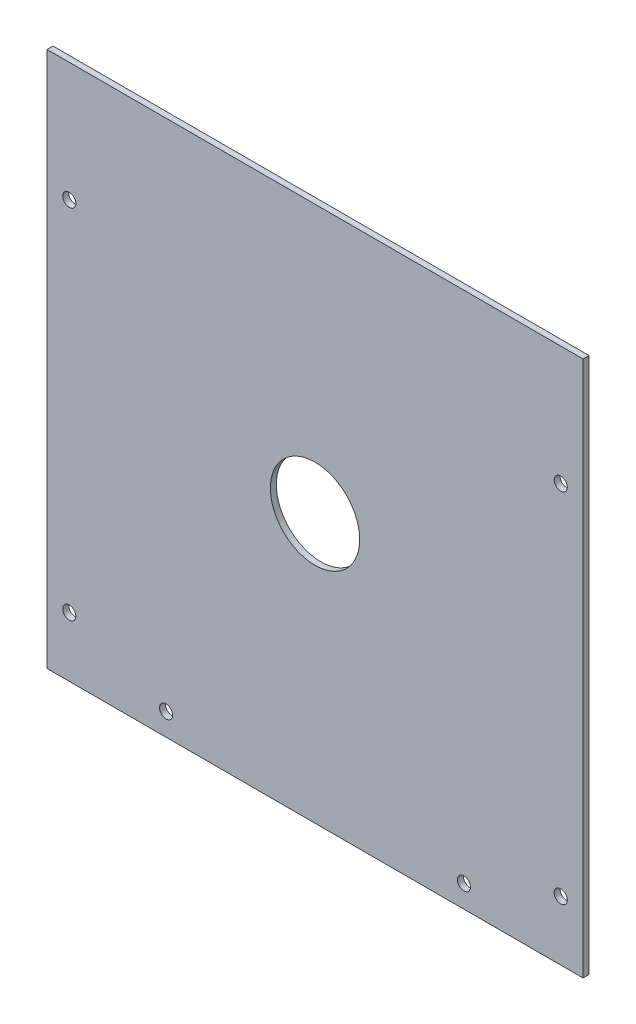
ISO-10303-21;
HEADER;
FILE_DESCRIPTION(('STEP AP214'),'2;1');
FILE_NAME('part.step','',(''),(''),'','','');
FILE_SCHEMA(('AUTOMOTIVE_DESIGN { 1 0 10303 214 1 1 1 1 }'));
ENDSEC;
DATA;
#1=APPLICATION_CONTEXT('core data for automotive mechanical design processes');
#2=APPLICATION_PROTOCOL_DEFINITION('international standard','automotive_design',2000,#1);
#3=PRODUCT_CONTEXT('',#1,'mechanical');
#4=PRODUCT('Part','Part','',(#3));
#5=PRODUCT_RELATED_PRODUCT_CATEGORY('part','',(#4));
#6=PRODUCT_DEFINITION_FORMATION('','',#4);
#7=PRODUCT_DEFINITION_CONTEXT('part definition',#1,'design');
#8=PRODUCT_DEFINITION('design','',#6,#7);
#9=PRODUCT_DEFINITION_SHAPE('','',#8);
#10=(LENGTH_UNIT() NAMED_UNIT(*) SI_UNIT(.MILLI.,.METRE.));
#11=(NAMED_UNIT(*) PLANE_ANGLE_UNIT() SI_UNIT($,.RADIAN.));
#12=(NAMED_UNIT(*) SI_UNIT($,.STERADIAN.) SOLID_ANGLE_UNIT());
#13=UNCERTAINTY_MEASURE_WITH_UNIT(LENGTH_MEASURE(1.E-05),#10,'distance_accuracy_value','');
#14=(GEOMETRIC_REPRESENTATION_CONTEXT(3) GLOBAL_UNCERTAINTY_ASSIGNED_CONTEXT((#13)) GLOBAL_UNIT_ASSIGNED_CONTEXT((#10,
#11,#12)) REPRESENTATION_CONTEXT('',''));
#15=CARTESIAN_POINT('',(0.,0.,0.));
#16=DIRECTION('',(0.,0.,1.));
#17=DIRECTION('',(1.,0.,0.));
#18=AXIS2_PLACEMENT_3D('',#15,#16,#17);
#19=CARTESIAN_POINT('',(90.,90.,2.));
#20=DIRECTION('',(-1.,0.,0.));
#21=DIRECTION('',(0.,-1.,0.));
#22=AXIS2_PLACEMENT_3D('',#19,#20,#21);
#23=PLANE('',#22);
#24=DIRECTION('',(0.,1.,0.));
#25=VECTOR('',#24,1.);
#26=CARTESIAN_POINT('',(90.,90.,0.));
#27=LINE('',#26,#25);
#28=CARTESIAN_POINT('',(90.,-90.,0.));
#29=VERTEX_POINT('',#28);
#30=CARTESIAN_POINT('',(90.,90.,0.));
#31=VERTEX_POINT('',#30);
#32=EDGE_CURVE('E105',#29,#31,#27,.T.);
#33=ORIENTED_EDGE('',*,*,#32,.T.);
#34=DIRECTION('',(0.,0.,-1.));
#35=VECTOR('',#34,1.);
#36=CARTESIAN_POINT('',(90.,90.,2.));
#37=LINE('',#36,#35);
#38=CARTESIAN_POINT('',(90.,90.,2.));
#39=VERTEX_POINT('',#38);
#40=EDGE_CURVE('E12',#39,#31,#37,.T.);
#41=ORIENTED_EDGE('',*,*,#40,.F.);
#42=DIRECTION('',(0.,1.,0.));
#43=VECTOR('',#42,1.);
#44=CARTESIAN_POINT('',(90.,90.,2.));
#45=LINE('',#44,#43);
#46=CARTESIAN_POINT('',(90.,-90.,2.));
#47=VERTEX_POINT('',#46);
#48=EDGE_CURVE('E93',#47,#39,#45,.T.);
#49=ORIENTED_EDGE('',*,*,#48,.F.);
#50=DIRECTION('',(0.,0.,-1.));
#51=VECTOR('',#50,1.);
#52=CARTESIAN_POINT('',(90.,-90.,2.));
#53=LINE('',#52,#51);
#54=EDGE_CURVE('E101',#47,#29,#53,.T.);
#55=ORIENTED_EDGE('',*,*,#54,.T.);
#56=EDGE_LOOP('',(#33,#41,#49,#55));
#57=FACE_BOUND('',#56,.T.);
#58=ADVANCED_FACE('F42',(#57),#23,.F.);
#59=CARTESIAN_POINT('',(-90.,90.,2.));
#60=DIRECTION('',(0.,-1.,0.));
#61=DIRECTION('',(0.,0.,-1.));
#62=AXIS2_PLACEMENT_3D('',#59,#60,#61);
#63=PLANE('',#62);
#64=DIRECTION('',(-1.,0.,0.));
#65=VECTOR('',#64,1.);
#66=CARTESIAN_POINT('',(-90.,90.,0.));
#67=LINE('',#66,#65);
#68=CARTESIAN_POINT('',(-90.,90.,0.));
#69=VERTEX_POINT('',#68);
#70=EDGE_CURVE('E97',#31,#69,#67,.T.);
#71=ORIENTED_EDGE('',*,*,#70,.T.);
#72=DIRECTION('',(0.,0.,-1.));
#73=VECTOR('',#72,1.);
#74=CARTESIAN_POINT('',(-90.,90.,2.));
#75=LINE('',#74,#73);
#76=CARTESIAN_POINT('',(-90.,90.,2.));
#77=VERTEX_POINT('',#76);
#78=EDGE_CURVE('E50',#77,#69,#75,.T.);
#79=ORIENTED_EDGE('',*,*,#78,.F.);
#80=DIRECTION('',(-1.,0.,0.));
#81=VECTOR('',#80,1.);
#82=CARTESIAN_POINT('',(-90.,90.,2.));
#83=LINE('',#82,#81);
#84=EDGE_CURVE('E88',#39,#77,#83,.T.);
#85=ORIENTED_EDGE('',*,*,#84,.F.);
#86=ORIENTED_EDGE('',*,*,#40,.T.);
#87=EDGE_LOOP('',(#71,#79,#85,#86));
#88=FACE_BOUND('',#87,.T.);
#89=ADVANCED_FACE('F96',(#88),#63,.F.);
#90=CARTESIAN_POINT('',(-90.,90.,2.));
#91=DIRECTION('',(1.,0.,0.));
#92=DIRECTION('',(0.,1.,0.));
#93=AXIS2_PLACEMENT_3D('',#90,#91,#92);
#94=PLANE('',#93);
#95=DIRECTION('',(0.,-1.,0.));
#96=VECTOR('',#95,1.);
#97=CARTESIAN_POINT('',(-90.,90.,0.));
#98=LINE('',#97,#96);
#99=CARTESIAN_POINT('',(-90.,-90.,0.));
#100=VERTEX_POINT('',#99);
#101=EDGE_CURVE('E75',#69,#100,#98,.T.);
#102=ORIENTED_EDGE('',*,*,#101,.T.);
#103=DIRECTION('',(0.,0.,-1.));
#104=VECTOR('',#103,1.);
#105=CARTESIAN_POINT('',(-90.,-90.,2.));
#106=LINE('',#105,#104);
#107=CARTESIAN_POINT('',(-90.,-90.,2.));
#108=VERTEX_POINT('',#107);
#109=EDGE_CURVE('E98',#108,#100,#106,.T.);
#110=ORIENTED_EDGE('',*,*,#109,.F.);
#111=DIRECTION('',(0.,-1.,0.));
#112=VECTOR('',#111,1.);
#113=CARTESIAN_POINT('',(-90.,90.,2.));
#114=LINE('',#113,#112);
#115=EDGE_CURVE('E91',#77,#108,#114,.T.);
#116=ORIENTED_EDGE('',*,*,#115,.F.);
#117=ORIENTED_EDGE('',*,*,#78,.T.);
#118=EDGE_LOOP('',(#102,#110,#116,#117));
#119=FACE_BOUND('',#118,.T.);
#120=ADVANCED_FACE('F99',(#119),#94,.F.);
#121=CARTESIAN_POINT('',(-90.,-90.,2.));
#122=DIRECTION('',(0.,1.,0.));
#123=DIRECTION('',(0.,0.,1.));
#124=AXIS2_PLACEMENT_3D('',#121,#122,#123);
#125=PLANE('',#124);
#126=DIRECTION('',(1.,0.,0.));
#127=VECTOR('',#126,1.);
#128=CARTESIAN_POINT('',(-90.,-90.,0.));
#129=LINE('',#128,#127);
#130=EDGE_CURVE('E81',#100,#29,#129,.T.);
#131=ORIENTED_EDGE('',*,*,#130,.T.);
#132=ORIENTED_EDGE('',*,*,#54,.F.);
#133=DIRECTION('',(1.,0.,0.));
#134=VECTOR('',#133,1.);
#135=CARTESIAN_POINT('',(-90.,-90.,2.));
#136=LINE('',#135,#134);
#137=EDGE_CURVE('E58',#108,#47,#136,.T.);
#138=ORIENTED_EDGE('',*,*,#137,.F.);
#139=ORIENTED_EDGE('',*,*,#109,.T.);
#140=EDGE_LOOP('',(#131,#132,#138,#139));
#141=FACE_BOUND('',#140,.T.);
#142=ADVANCED_FACE('F113',(#141),#125,.F.);
#143=CARTESIAN_POINT('',(0.,0.,2.));
#144=DIRECTION('',(0.,0.,1.));
#145=DIRECTION('',(1.,0.,0.));
#146=AXIS2_PLACEMENT_3D('',#143,#144,#145);
#147=PLANE('',#146);
#148=CARTESIAN_POINT('',(82.5,-70.,2.));
#149=DIRECTION('',(0.,0.,1.));
#150=DIRECTION('',(1.,0.,0.));
#151=AXIS2_PLACEMENT_3D('',#148,#149,#150);
#152=CIRCLE('',#151,2.20000000000001);
#153=CARTESIAN_POINT('',(84.7,-70.,2.));
#154=VERTEX_POINT('',#153);
#155=EDGE_CURVE('E129',#154,#154,#152,.T.);
#156=ORIENTED_EDGE('',*,*,#155,.F.);
#157=EDGE_LOOP('',(#156));
#158=FACE_BOUND('',#157,.T.);
#159=CARTESIAN_POINT('',(-82.5,50.,2.));
#160=DIRECTION('',(0.,0.,1.));
#161=DIRECTION('',(1.,0.,0.));
#162=AXIS2_PLACEMENT_3D('',#159,#160,#161);
#163=CIRCLE('',#162,2.20000000000001);
#164=CARTESIAN_POINT('',(-80.3,50.,2.));
#165=VERTEX_POINT('',#164);
#166=EDGE_CURVE('E139',#165,#165,#163,.T.);
#167=ORIENTED_EDGE('',*,*,#166,.F.);
#168=EDGE_LOOP('',(#167));
#169=FACE_BOUND('',#168,.T.);
#170=CARTESIAN_POINT('',(-82.5,-70.,2.));
#171=DIRECTION('',(0.,0.,1.));
#172=DIRECTION('',(1.,0.,0.));
#173=AXIS2_PLACEMENT_3D('',#170,#171,#172);
#174=CIRCLE('',#173,2.20000000000001);
#175=CARTESIAN_POINT('',(-80.3,-70.,2.));
#176=VERTEX_POINT('',#175);
#177=EDGE_CURVE('E142',#176,#176,#174,.T.);
#178=ORIENTED_EDGE('',*,*,#177,.F.);
#179=EDGE_LOOP('',(#178));
#180=FACE_BOUND('',#179,.T.);
#181=CARTESIAN_POINT('',(82.5,50.,2.));
#182=DIRECTION('',(0.,0.,1.));
#183=DIRECTION('',(1.,0.,0.));
#184=AXIS2_PLACEMENT_3D('',#181,#182,#183);
#185=CIRCLE('',#184,2.19999999999999);
#186=CARTESIAN_POINT('',(84.7,50.,2.));
#187=VERTEX_POINT('',#186);
#188=EDGE_CURVE('E145',#187,#187,#185,.T.);
#189=ORIENTED_EDGE('',*,*,#188,.F.);
#190=EDGE_LOOP('',(#189));
#191=FACE_BOUND('',#190,.T.);
#192=CARTESIAN_POINT('',(50.,-82.5,2.));
#193=DIRECTION('',(0.,0.,-1.));
#194=DIRECTION('',(-1.,0.,0.));
#195=AXIS2_PLACEMENT_3D('',#192,#193,#194);
#196=CIRCLE('',#195,2.2);
#197=CARTESIAN_POINT('',(47.8,-82.5,2.));
#198=VERTEX_POINT('',#197);
#199=EDGE_CURVE('E122',#198,#198,#196,.T.);
#200=ORIENTED_EDGE('',*,*,#199,.T.);
#201=EDGE_LOOP('',(#200));
#202=FACE_BOUND('',#201,.T.);
#203=CARTESIAN_POINT('',(-50.,-82.5,2.));
#204=DIRECTION('',(0.,0.,-1.));
#205=DIRECTION('',(-1.,0.,0.));
#206=AXIS2_PLACEMENT_3D('',#203,#204,#205);
#207=CIRCLE('',#206,2.2);
#208=CARTESIAN_POINT('',(-52.2,-82.5,2.));
#209=VERTEX_POINT('',#208);
#210=EDGE_CURVE('E128',#209,#209,#207,.T.);
#211=ORIENTED_EDGE('',*,*,#210,.T.);
#212=EDGE_LOOP('',(#211));
#213=FACE_BOUND('',#212,.T.);
#214=CARTESIAN_POINT('',(0.,0.,2.));
#215=DIRECTION('',(0.,0.,1.));
#216=DIRECTION('',(1.,0.,0.));
#217=AXIS2_PLACEMENT_3D('',#214,#215,#216);
#218=CIRCLE('',#217,15.);
#219=CARTESIAN_POINT('',(15.,0.,2.));
#220=VERTEX_POINT('',#219);
#221=EDGE_CURVE('E119',#220,#220,#218,.T.);
#222=ORIENTED_EDGE('',*,*,#221,.F.);
#223=EDGE_LOOP('',(#222));
#224=FACE_BOUND('',#223,.T.);
#225=ORIENTED_EDGE('',*,*,#48,.T.);
#226=ORIENTED_EDGE('',*,*,#84,.T.);
#227=ORIENTED_EDGE('',*,*,#115,.T.);
#228=ORIENTED_EDGE('',*,*,#137,.T.);
#229=EDGE_LOOP('',(#225,#226,#227,#228));
#230=FACE_BOUND('',#229,.T.);
#231=ADVANCED_FACE('F89',(#158,#169,#180,#191,#202,#213,#224,#230),#147,.T.);
#232=CARTESIAN_POINT('',(0.,0.,0.));
#233=DIRECTION('',(0.,0.,1.));
#234=DIRECTION('',(1.,0.,0.));
#235=AXIS2_PLACEMENT_3D('',#232,#233,#234);
#236=PLANE('',#235);
#237=CARTESIAN_POINT('',(82.5,-70.,0.));
#238=DIRECTION('',(0.,0.,-1.));
#239=DIRECTION('',(-1.,0.,0.));
#240=AXIS2_PLACEMENT_3D('',#237,#238,#239);
#241=CIRCLE('',#240,2.20000000000001);
#242=CARTESIAN_POINT('',(80.3,-70.,0.));
#243=VERTEX_POINT('',#242);
#244=EDGE_CURVE('E151',#243,#243,#241,.T.);
#245=ORIENTED_EDGE('',*,*,#244,.F.);
#246=EDGE_LOOP('',(#245));
#247=FACE_BOUND('',#246,.T.);
#248=CARTESIAN_POINT('',(-82.5,50.,0.));
#249=DIRECTION('',(0.,0.,-1.));
#250=DIRECTION('',(-1.,0.,0.));
#251=AXIS2_PLACEMENT_3D('',#248,#249,#250);
#252=CIRCLE('',#251,2.20000000000001);
#253=CARTESIAN_POINT('',(-84.7,50.,0.));
#254=VERTEX_POINT('',#253);
#255=EDGE_CURVE('E152',#254,#254,#252,.T.);
#256=ORIENTED_EDGE('',*,*,#255,.F.);
#257=EDGE_LOOP('',(#256));
#258=FACE_BOUND('',#257,.T.);
#259=CARTESIAN_POINT('',(-82.5,-70.,0.));
#260=DIRECTION('',(0.,0.,-1.));
#261=DIRECTION('',(-1.,0.,0.));
#262=AXIS2_PLACEMENT_3D('',#259,#260,#261);
#263=CIRCLE('',#262,2.20000000000001);
#264=CARTESIAN_POINT('',(-84.7,-70.,0.));
#265=VERTEX_POINT('',#264);
#266=EDGE_CURVE('E155',#265,#265,#263,.T.);
#267=ORIENTED_EDGE('',*,*,#266,.F.);
#268=EDGE_LOOP('',(#267));
#269=FACE_BOUND('',#268,.T.);
#270=CARTESIAN_POINT('',(82.5,50.,0.));
#271=DIRECTION('',(0.,0.,-1.));
#272=DIRECTION('',(-1.,0.,0.));
#273=AXIS2_PLACEMENT_3D('',#270,#271,#272);
#274=CIRCLE('',#273,2.19999999999999);
#275=CARTESIAN_POINT('',(80.3,50.,0.));
#276=VERTEX_POINT('',#275);
#277=EDGE_CURVE('E148',#276,#276,#274,.T.);
#278=ORIENTED_EDGE('',*,*,#277,.F.);
#279=EDGE_LOOP('',(#278));
#280=FACE_BOUND('',#279,.T.);
#281=CARTESIAN_POINT('',(50.,-82.5,0.));
#282=DIRECTION('',(0.,0.,-1.));
#283=DIRECTION('',(-1.,0.,0.));
#284=AXIS2_PLACEMENT_3D('',#281,#282,#283);
#285=CIRCLE('',#284,2.2);
#286=CARTESIAN_POINT('',(47.8,-82.5,0.));
#287=VERTEX_POINT('',#286);
#288=EDGE_CURVE('E132',#287,#287,#285,.T.);
#289=ORIENTED_EDGE('',*,*,#288,.F.);
#290=EDGE_LOOP('',(#289));
#291=FACE_BOUND('',#290,.T.);
#292=CARTESIAN_POINT('',(-50.,-82.5,0.));
#293=DIRECTION('',(0.,0.,-1.));
#294=DIRECTION('',(-1.,0.,0.));
#295=AXIS2_PLACEMENT_3D('',#292,#293,#294);
#296=CIRCLE('',#295,2.2);
#297=CARTESIAN_POINT('',(-52.2,-82.5,0.));
#298=VERTEX_POINT('',#297);
#299=EDGE_CURVE('E125',#298,#298,#296,.T.);
#300=ORIENTED_EDGE('',*,*,#299,.F.);
#301=EDGE_LOOP('',(#300));
#302=FACE_BOUND('',#301,.T.);
#303=CARTESIAN_POINT('',(0.,0.,0.));
#304=DIRECTION('',(0.,0.,1.));
#305=DIRECTION('',(1.,0.,0.));
#306=AXIS2_PLACEMENT_3D('',#303,#304,#305);
#307=CIRCLE('',#306,15.);
#308=CARTESIAN_POINT('',(15.,0.,0.));
#309=VERTEX_POINT('',#308);
#310=EDGE_CURVE('E108',#309,#309,#307,.T.);
#311=ORIENTED_EDGE('',*,*,#310,.T.);
#312=EDGE_LOOP('',(#311));
#313=FACE_BOUND('',#312,.T.);
#314=ORIENTED_EDGE('',*,*,#32,.F.);
#315=ORIENTED_EDGE('',*,*,#130,.F.);
#316=ORIENTED_EDGE('',*,*,#101,.F.);
#317=ORIENTED_EDGE('',*,*,#70,.F.);
#318=EDGE_LOOP('',(#314,#315,#316,#317));
#319=FACE_BOUND('',#318,.T.);
#320=ADVANCED_FACE('F116',(#247,#258,#269,#280,#291,#302,#313,#319),#236,.F.);
#321=CARTESIAN_POINT('',(0.,0.,0.));
#322=DIRECTION('',(0.,0.,1.));
#323=DIRECTION('',(1.,0.,0.));
#324=AXIS2_PLACEMENT_3D('',#321,#322,#323);
#325=CYLINDRICAL_SURFACE('',#324,15.);
#326=ORIENTED_EDGE('',*,*,#310,.F.);
#327=EDGE_LOOP('',(#326));
#328=FACE_BOUND('',#327,.T.);
#329=ORIENTED_EDGE('',*,*,#221,.T.);
#330=EDGE_LOOP('',(#329));
#331=FACE_BOUND('',#330,.T.);
#332=ADVANCED_FACE('F165',(#328,#331),#325,.F.);
#333=CARTESIAN_POINT('',(-50.,-82.5,2.));
#334=DIRECTION('',(0.,0.,-1.));
#335=DIRECTION('',(-1.,0.,0.));
#336=AXIS2_PLACEMENT_3D('',#333,#334,#335);
#337=CYLINDRICAL_SURFACE('',#336,2.2);
#338=ORIENTED_EDGE('',*,*,#210,.F.);
#339=EDGE_LOOP('',(#338));
#340=FACE_BOUND('',#339,.T.);
#341=ORIENTED_EDGE('',*,*,#299,.T.);
#342=EDGE_LOOP('',(#341));
#343=FACE_BOUND('',#342,.T.);
#344=ADVANCED_FACE('F178',(#340,#343),#337,.F.);
#345=CARTESIAN_POINT('',(50.,-82.5,2.));
#346=DIRECTION('',(0.,0.,-1.));
#347=DIRECTION('',(-1.,0.,0.));
#348=AXIS2_PLACEMENT_3D('',#345,#346,#347);
#349=CYLINDRICAL_SURFACE('',#348,2.2);
#350=ORIENTED_EDGE('',*,*,#199,.F.);
#351=EDGE_LOOP('',(#350));
#352=FACE_BOUND('',#351,.T.);
#353=ORIENTED_EDGE('',*,*,#288,.T.);
#354=EDGE_LOOP('',(#353));
#355=FACE_BOUND('',#354,.T.);
#356=ADVANCED_FACE('F227',(#352,#355),#349,.F.);
#357=CARTESIAN_POINT('',(82.5,50.,160.));
#358=DIRECTION('',(0.,0.,-1.));
#359=DIRECTION('',(-1.,0.,0.));
#360=AXIS2_PLACEMENT_3D('',#357,#358,#359);
#361=CYLINDRICAL_SURFACE('',#360,2.19999999999999);
#362=ORIENTED_EDGE('',*,*,#188,.T.);
#363=EDGE_LOOP('',(#362));
#364=FACE_BOUND('',#363,.T.);
#365=ORIENTED_EDGE('',*,*,#277,.T.);
#366=EDGE_LOOP('',(#365));
#367=FACE_BOUND('',#366,.T.);
#368=ADVANCED_FACE('F234',(#364,#367),#361,.F.);
#369=CARTESIAN_POINT('',(-82.5,-70.,160.));
#370=DIRECTION('',(0.,0.,-1.));
#371=DIRECTION('',(-1.,0.,0.));
#372=AXIS2_PLACEMENT_3D('',#369,#370,#371);
#373=CYLINDRICAL_SURFACE('',#372,2.20000000000001);
#374=ORIENTED_EDGE('',*,*,#177,.T.);
#375=EDGE_LOOP('',(#374));
#376=FACE_BOUND('',#375,.T.);
#377=ORIENTED_EDGE('',*,*,#266,.T.);
#378=EDGE_LOOP('',(#377));
#379=FACE_BOUND('',#378,.T.);
#380=ADVANCED_FACE('F161',(#376,#379),#373,.F.);
#381=CARTESIAN_POINT('',(-82.5,50.,160.));
#382=DIRECTION('',(0.,0.,-1.));
#383=DIRECTION('',(-1.,0.,0.));
#384=AXIS2_PLACEMENT_3D('',#381,#382,#383);
#385=CYLINDRICAL_SURFACE('',#384,2.20000000000001);
#386=ORIENTED_EDGE('',*,*,#166,.T.);
#387=EDGE_LOOP('',(#386));
#388=FACE_BOUND('',#387,.T.);
#389=ORIENTED_EDGE('',*,*,#255,.T.);
#390=EDGE_LOOP('',(#389));
#391=FACE_BOUND('',#390,.T.);
#392=ADVANCED_FACE('F248',(#388,#391),#385,.F.);
#393=CARTESIAN_POINT('',(82.5,-70.,160.));
#394=DIRECTION('',(0.,0.,-1.));
#395=DIRECTION('',(-1.,0.,0.));
#396=AXIS2_PLACEMENT_3D('',#393,#394,#395);
#397=CYLINDRICAL_SURFACE('',#396,2.20000000000001);
#398=ORIENTED_EDGE('',*,*,#155,.T.);
#399=EDGE_LOOP('',(#398));
#400=FACE_BOUND('',#399,.T.);
#401=ORIENTED_EDGE('',*,*,#244,.T.);
#402=EDGE_LOOP('',(#401));
#403=FACE_BOUND('',#402,.T.);
#404=ADVANCED_FACE('F256',(#400,#403),#397,.F.);
#405=CLOSED_SHELL('',(#58,#89,#120,#142,#231,#320,#332,#344,#356,#368,#380,#392,#404));
#406=MANIFOLD_SOLID_BREP('B2',#405);
#407=ADVANCED_BREP_SHAPE_REPRESENTATION('',(#18,#406),#14);
#408=SHAPE_DEFINITION_REPRESENTATION(#9,#407);
ENDSEC;
END-ISO-10303-21;
